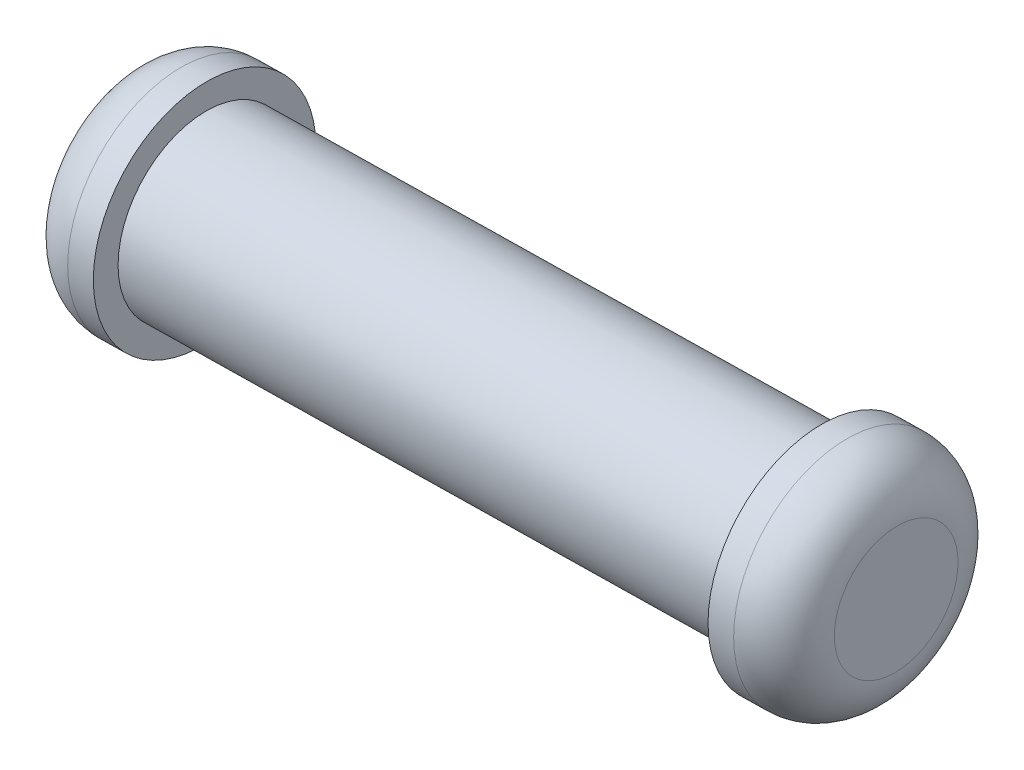
ISO-10303-21;
HEADER;
FILE_DESCRIPTION(('STEP AP214'),'2;1');
FILE_NAME('part.step','',(''),(''),'','','');
FILE_SCHEMA(('AUTOMOTIVE_DESIGN { 1 0 10303 214 1 1 1 1 }'));
ENDSEC;
DATA;
#1=APPLICATION_CONTEXT('core data for automotive mechanical design processes');
#2=APPLICATION_PROTOCOL_DEFINITION('international standard','automotive_design',2000,#1);
#3=PRODUCT_CONTEXT('',#1,'mechanical');
#4=PRODUCT('Part','Part','',(#3));
#5=PRODUCT_RELATED_PRODUCT_CATEGORY('part','',(#4));
#6=PRODUCT_DEFINITION_FORMATION('','',#4);
#7=PRODUCT_DEFINITION_CONTEXT('part definition',#1,'design');
#8=PRODUCT_DEFINITION('design','',#6,#7);
#9=PRODUCT_DEFINITION_SHAPE('','',#8);
#10=(LENGTH_UNIT() NAMED_UNIT(*) SI_UNIT(.MILLI.,.METRE.));
#11=(NAMED_UNIT(*) PLANE_ANGLE_UNIT() SI_UNIT($,.RADIAN.));
#12=(NAMED_UNIT(*) SI_UNIT($,.STERADIAN.) SOLID_ANGLE_UNIT());
#13=UNCERTAINTY_MEASURE_WITH_UNIT(LENGTH_MEASURE(1.E-05),#10,'distance_accuracy_value','');
#14=(GEOMETRIC_REPRESENTATION_CONTEXT(3) GLOBAL_UNCERTAINTY_ASSIGNED_CONTEXT((#13)) GLOBAL_UNIT_ASSIGNED_CONTEXT((#10,
#11,#12)) REPRESENTATION_CONTEXT('',''));
#15=CARTESIAN_POINT('',(0.,0.,0.));
#16=DIRECTION('',(0.,0.,1.));
#17=DIRECTION('',(1.,0.,0.));
#18=AXIS2_PLACEMENT_3D('',#15,#16,#17);
#19=CARTESIAN_POINT('',(-33.1163212241809,26.7347311363403,-0.720606810227928));
#20=DIRECTION('',(-0.999850251585223,0.,0.0173053288025827));
#21=DIRECTION('',(0.0173053288025827,0.,0.999850251585224));
#22=AXIS2_PLACEMENT_3D('',#19,#20,#21);
#23=CYLINDRICAL_SURFACE('',#22,1.75);
#24=CARTESIAN_POINT('',(-38.0653274756498,26.7347311363403,-0.634949802799144));
#25=DIRECTION('',(-0.999850251585224,0.,0.0173053288025827));
#26=DIRECTION('',(0.0173053288025827,0.,0.999850251585223));
#27=AXIS2_PLACEMENT_3D('',#24,#25,#26);
#28=CIRCLE('',#27,1.75);
#29=CARTESIAN_POINT('',(-38.0350431502452,26.7347311363403,1.114788137475));
#30=VERTEX_POINT('',#29);
#31=EDGE_CURVE('E62',#30,#30,#28,.F.);
#32=ORIENTED_EDGE('',*,*,#31,.F.);
#33=EDGE_LOOP('',(#32));
#34=FACE_BOUND('',#33,.T.);
#35=CARTESIAN_POINT('',(-50.0635304946724,26.7347311363403,-0.427285857168152));
#36=DIRECTION('',(-0.999850251585223,0.,0.0173053288025827));
#37=DIRECTION('',(0.0173053288025827,0.,0.999850251585223));
#38=AXIS2_PLACEMENT_3D('',#35,#36,#37);
#39=CIRCLE('',#38,1.75);
#40=CARTESIAN_POINT('',(-50.0332461692679,26.7347311363403,1.32245208310599));
#41=VERTEX_POINT('',#40);
#42=EDGE_CURVE('E66',#41,#41,#39,.T.);
#43=ORIENTED_EDGE('',*,*,#42,.F.);
#44=EDGE_LOOP('',(#43));
#45=FACE_BOUND('',#44,.T.);
#46=ADVANCED_FACE('F36',(#34,#45),#23,.T.);
#47=CARTESIAN_POINT('',(-51.5633058720503,26.7347311363403,-0.401327863964278));
#48=DIRECTION('',(0.999850251585223,0.,-0.0173053288025827));
#49=DIRECTION('',(-0.0173053288025827,0.,-0.999850251585223));
#50=AXIS2_PLACEMENT_3D('',#47,#48,#49);
#51=CYLINDRICAL_SURFACE('',#50,2.25);
#52=CARTESIAN_POINT('',(-50.5634556204651,26.7347311363403,-0.41863319276686));
#53=DIRECTION('',(-0.999850251585223,0.,0.0173053288025827));
#54=DIRECTION('',(0.0173053288025827,0.,0.999850251585223));
#55=AXIS2_PLACEMENT_3D('',#52,#53,#54);
#56=CIRCLE('',#55,2.25);
#57=CARTESIAN_POINT('',(-50.5245186306593,26.7347311363403,1.83102987329989));
#58=VERTEX_POINT('',#57);
#59=EDGE_CURVE('E51',#58,#58,#56,.F.);
#60=ORIENTED_EDGE('',*,*,#59,.T.);
#61=EDGE_LOOP('',(#60));
#62=FACE_BOUND('',#61,.T.);
#63=CARTESIAN_POINT('',(-50.0635304946725,26.7347311363403,-0.427285857168152));
#64=DIRECTION('',(-0.999850251585223,0.,0.0173053288025827));
#65=DIRECTION('',(0.0173053288025827,0.,0.999850251585223));
#66=AXIS2_PLACEMENT_3D('',#63,#64,#65);
#67=CIRCLE('',#66,2.25);
#68=CARTESIAN_POINT('',(-50.0245935048667,26.7347311363403,1.8223772088986));
#69=VERTEX_POINT('',#68);
#70=EDGE_CURVE('E69',#69,#69,#67,.T.);
#71=ORIENTED_EDGE('',*,*,#70,.T.);
#72=EDGE_LOOP('',(#71));
#73=FACE_BOUND('',#72,.T.);
#74=ADVANCED_FACE('F93',(#62,#73),#51,.T.);
#75=CARTESIAN_POINT('',(-51.5633058720503,26.7347311363403,-0.401327863964278));
#76=DIRECTION('',(-0.999850251585223,0.,0.0173053288025827));
#77=DIRECTION('',(0.0173053288025827,0.,0.999850251585223));
#78=AXIS2_PLACEMENT_3D('',#75,#76,#77);
#79=PLANE('',#78);
#80=CARTESIAN_POINT('',(-51.5633058720503,26.7347311363403,-0.401327863964278));
#81=DIRECTION('',(-0.999850251585223,0.,0.0173053288025827));
#82=DIRECTION('',(0.0173053288025827,0.,0.999850251585223));
#83=AXIS2_PLACEMENT_3D('',#80,#81,#82);
#84=CIRCLE('',#83,1.25);
#85=CARTESIAN_POINT('',(-51.5416742110471,26.7347311363403,0.848484950517251));
#86=VERTEX_POINT('',#85);
#87=EDGE_CURVE('E57',#86,#86,#84,.T.);
#88=ORIENTED_EDGE('',*,*,#87,.T.);
#89=EDGE_LOOP('',(#88));
#90=FACE_BOUND('',#89,.T.);
#91=ADVANCED_FACE('F99',(#90),#79,.T.);
#92=CARTESIAN_POINT('',(-50.0635304946725,26.7347311363403,-0.427285857168152));
#93=DIRECTION('',(-0.999850251585223,0.,0.0173053288025827));
#94=DIRECTION('',(0.0173053288025827,0.,0.999850251585223));
#95=AXIS2_PLACEMENT_3D('',#92,#93,#94);
#96=PLANE('',#95);
#97=ORIENTED_EDGE('',*,*,#42,.T.);
#98=EDGE_LOOP('',(#97));
#99=FACE_BOUND('',#98,.T.);
#100=ORIENTED_EDGE('',*,*,#70,.F.);
#101=EDGE_LOOP('',(#100));
#102=FACE_BOUND('',#101,.T.);
#103=ADVANCED_FACE('F105',(#99,#102),#96,.F.);
#104=CARTESIAN_POINT('',(-36.565552098272,26.7347311363403,-0.660907796003018));
#105=DIRECTION('',(-0.999850251585223,0.,0.0173053288025827));
#106=DIRECTION('',(0.0173053288025827,0.,0.999850251585223));
#107=AXIS2_PLACEMENT_3D('',#104,#105,#106);
#108=CYLINDRICAL_SURFACE('',#107,2.25);
#109=CARTESIAN_POINT('',(-37.5654023498572,26.7347311363403,-0.643602467200435));
#110=DIRECTION('',(0.999850251585223,0.,-0.0173053288025827));
#111=DIRECTION('',(-0.0173053288025827,0.,-0.999850251585223));
#112=AXIS2_PLACEMENT_3D('',#109,#110,#111);
#113=CIRCLE('',#112,2.25);
#114=CARTESIAN_POINT('',(-37.604339339663,26.7347311363403,-2.89326553326719));
#115=VERTEX_POINT('',#114);
#116=EDGE_CURVE('E10',#115,#115,#113,.F.);
#117=ORIENTED_EDGE('',*,*,#116,.T.);
#118=EDGE_LOOP('',(#117));
#119=FACE_BOUND('',#118,.T.);
#120=CARTESIAN_POINT('',(-38.0653274756498,26.7347311363403,-0.634949802799144));
#121=DIRECTION('',(0.999850251585223,0.,-0.0173053288025827));
#122=DIRECTION('',(-0.0173053288025827,0.,-0.999850251585223));
#123=AXIS2_PLACEMENT_3D('',#120,#121,#122);
#124=CIRCLE('',#123,2.25);
#125=CARTESIAN_POINT('',(-38.1042644654556,26.7347311363403,-2.88461286886589));
#126=VERTEX_POINT('',#125);
#127=EDGE_CURVE('E72',#126,#126,#124,.T.);
#128=ORIENTED_EDGE('',*,*,#127,.T.);
#129=EDGE_LOOP('',(#128));
#130=FACE_BOUND('',#129,.T.);
#131=ADVANCED_FACE('F77',(#119,#130),#108,.T.);
#132=CARTESIAN_POINT('',(-36.565552098272,26.7347311363403,-0.660907796003018));
#133=DIRECTION('',(0.999850251585223,0.,-0.0173053288025827));
#134=DIRECTION('',(-0.0173053288025827,0.,-0.999850251585223));
#135=AXIS2_PLACEMENT_3D('',#132,#133,#134);
#136=PLANE('',#135);
#137=CARTESIAN_POINT('',(-36.565552098272,26.7347311363403,-0.660907796003018));
#138=DIRECTION('',(0.999850251585223,0.,-0.0173053288025827));
#139=DIRECTION('',(-0.0173053288025827,0.,-0.999850251585223));
#140=AXIS2_PLACEMENT_3D('',#137,#138,#139);
#141=CIRCLE('',#140,1.25);
#142=CARTESIAN_POINT('',(-36.5871837592752,26.7347311363403,-1.91072061048455));
#143=VERTEX_POINT('',#142);
#144=EDGE_CURVE('E44',#143,#143,#141,.T.);
#145=ORIENTED_EDGE('',*,*,#144,.T.);
#146=EDGE_LOOP('',(#145));
#147=FACE_BOUND('',#146,.T.);
#148=ADVANCED_FACE('F82',(#147),#136,.T.);
#149=CARTESIAN_POINT('',(-38.0653274756498,26.7347311363403,-0.634949802799144));
#150=DIRECTION('',(0.999850251585223,0.,-0.0173053288025827));
#151=DIRECTION('',(-0.0173053288025827,0.,-0.999850251585223));
#152=AXIS2_PLACEMENT_3D('',#149,#150,#151);
#153=PLANE('',#152);
#154=ORIENTED_EDGE('',*,*,#31,.T.);
#155=EDGE_LOOP('',(#154));
#156=FACE_BOUND('',#155,.T.);
#157=ORIENTED_EDGE('',*,*,#127,.F.);
#158=EDGE_LOOP('',(#157));
#159=FACE_BOUND('',#158,.T.);
#160=ADVANCED_FACE('F79',(#156,#159),#153,.F.);
#161=CARTESIAN_POINT('',(-50.5634556204651,26.7347311363403,-0.41863319276686));
#162=DIRECTION('',(-0.999850251585223,0.,0.0173053288025827));
#163=DIRECTION('',(0.0173053288025827,0.,0.999850251585223));
#164=AXIS2_PLACEMENT_3D('',#161,#162,#163);
#165=TOROIDAL_SURFACE('',#164,1.25,1.);
#166=ORIENTED_EDGE('',*,*,#59,.F.);
#167=EDGE_LOOP('',(#166));
#168=FACE_BOUND('',#167,.T.);
#169=ORIENTED_EDGE('',*,*,#87,.F.);
#170=EDGE_LOOP('',(#169));
#171=FACE_BOUND('',#170,.T.);
#172=ADVANCED_FACE('F81',(#168,#171),#165,.T.);
#173=CARTESIAN_POINT('',(-37.5654023498572,26.7347311363403,-0.643602467200435));
#174=DIRECTION('',(0.999850251585223,0.,-0.0173053288025827));
#175=DIRECTION('',(-0.0173053288025827,0.,-0.999850251585223));
#176=AXIS2_PLACEMENT_3D('',#173,#174,#175);
#177=TOROIDAL_SURFACE('',#176,1.25,1.);
#178=ORIENTED_EDGE('',*,*,#116,.F.);
#179=EDGE_LOOP('',(#178));
#180=FACE_BOUND('',#179,.T.);
#181=ORIENTED_EDGE('',*,*,#144,.F.);
#182=EDGE_LOOP('',(#181));
#183=FACE_BOUND('',#182,.T.);
#184=ADVANCED_FACE('F38',(#180,#183),#177,.T.);
#185=CLOSED_SHELL('',(#46,#74,#91,#103,#131,#148,#160,#172,#184));
#186=MANIFOLD_SOLID_BREP('B2',#185);
#187=ADVANCED_BREP_SHAPE_REPRESENTATION('',(#18,#186),#14);
#188=SHAPE_DEFINITION_REPRESENTATION(#9,#187);
ENDSEC;
END-ISO-10303-21;
